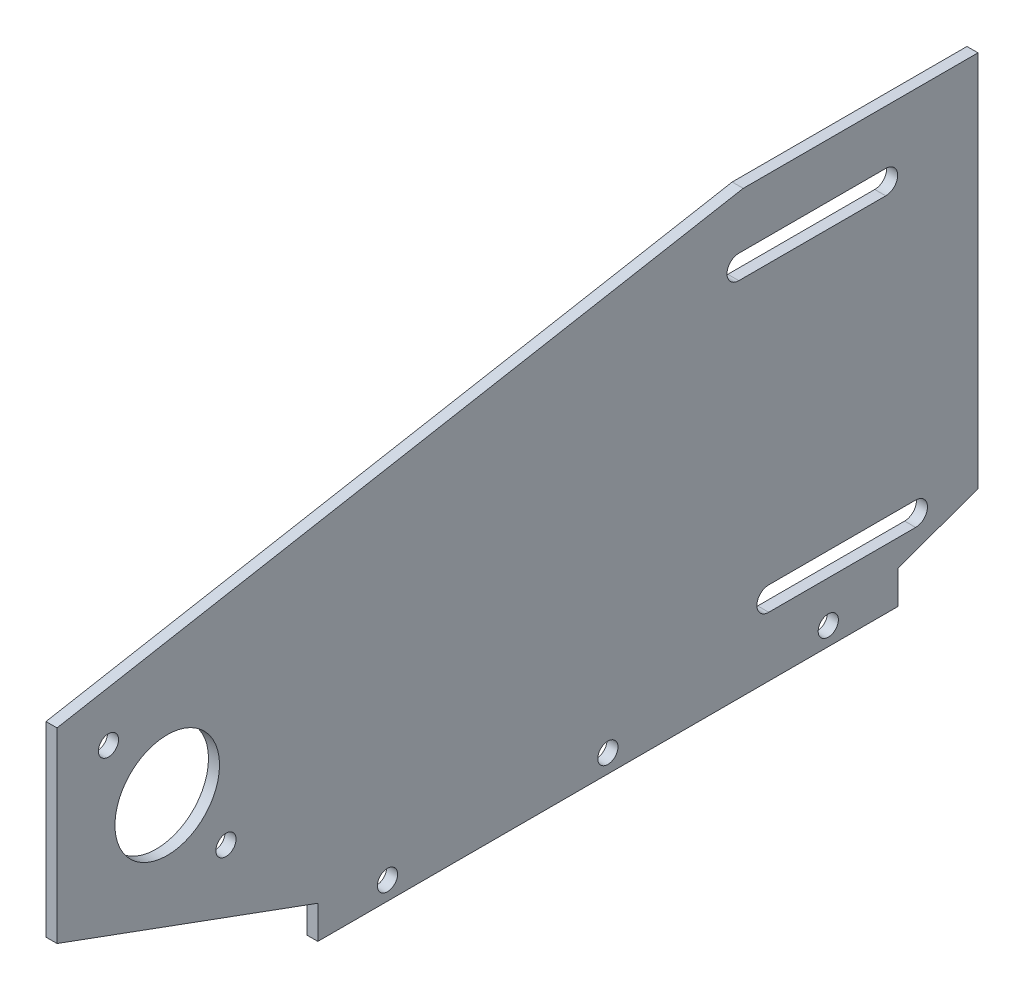
ISO-10303-21;
HEADER;
FILE_DESCRIPTION(('STEP AP214'),'2;1');
FILE_NAME('part.step','',(''),(''),'','','');
FILE_SCHEMA(('AUTOMOTIVE_DESIGN { 1 0 10303 214 1 1 1 1 }'));
ENDSEC;
DATA;
#1=APPLICATION_CONTEXT('core data for automotive mechanical design processes');
#2=APPLICATION_PROTOCOL_DEFINITION('international standard','automotive_design',2000,#1);
#3=PRODUCT_CONTEXT('',#1,'mechanical');
#4=PRODUCT('Part','Part','',(#3));
#5=PRODUCT_RELATED_PRODUCT_CATEGORY('part','',(#4));
#6=PRODUCT_DEFINITION_FORMATION('','',#4);
#7=PRODUCT_DEFINITION_CONTEXT('part definition',#1,'design');
#8=PRODUCT_DEFINITION('design','',#6,#7);
#9=PRODUCT_DEFINITION_SHAPE('','',#8);
#10=(LENGTH_UNIT() NAMED_UNIT(*) SI_UNIT(.MILLI.,.METRE.));
#11=(NAMED_UNIT(*) PLANE_ANGLE_UNIT() SI_UNIT($,.RADIAN.));
#12=(NAMED_UNIT(*) SI_UNIT($,.STERADIAN.) SOLID_ANGLE_UNIT());
#13=UNCERTAINTY_MEASURE_WITH_UNIT(LENGTH_MEASURE(1.E-05),#10,'distance_accuracy_value','');
#14=(GEOMETRIC_REPRESENTATION_CONTEXT(3) GLOBAL_UNCERTAINTY_ASSIGNED_CONTEXT((#13)) GLOBAL_UNIT_ASSIGNED_CONTEXT((#10,
#11,#12)) REPRESENTATION_CONTEXT('',''));
#15=CARTESIAN_POINT('',(0.,0.,0.));
#16=DIRECTION('',(0.,0.,1.));
#17=DIRECTION('',(1.,0.,0.));
#18=AXIS2_PLACEMENT_3D('',#15,#16,#17);
#19=CARTESIAN_POINT('',(3.,0.,0.));
#20=DIRECTION('',(-1.,0.,0.));
#21=DIRECTION('',(0.,0.,1.));
#22=AXIS2_PLACEMENT_3D('',#19,#20,#21);
#23=PLANE('',#22);
#24=CARTESIAN_POINT('',(3.,4.99999999999997,-209.962016184999));
#25=DIRECTION('',(-1.,0.,0.));
#26=DIRECTION('',(0.,0.,1.));
#27=AXIS2_PLACEMENT_3D('',#24,#25,#26);
#28=CIRCLE('',#27,2.75000000000001);
#29=CARTESIAN_POINT('',(3.,4.99999999999997,-207.212016184999));
#30=VERTEX_POINT('',#29);
#31=EDGE_CURVE('E187',#30,#30,#28,.T.);
#32=ORIENTED_EDGE('',*,*,#31,.T.);
#33=EDGE_LOOP('',(#32));
#34=FACE_BOUND('',#33,.T.);
#35=CARTESIAN_POINT('',(3.,4.99999999999997,-149.962016184999));
#36=DIRECTION('',(-1.,0.,0.));
#37=DIRECTION('',(0.,0.,1.));
#38=AXIS2_PLACEMENT_3D('',#35,#36,#37);
#39=CIRCLE('',#38,2.75000000000001);
#40=CARTESIAN_POINT('',(3.,4.99999999999997,-147.212016184999));
#41=VERTEX_POINT('',#40);
#42=EDGE_CURVE('E290',#41,#41,#39,.T.);
#43=ORIENTED_EDGE('',*,*,#42,.T.);
#44=EDGE_LOOP('',(#43));
#45=FACE_BOUND('',#44,.T.);
#46=CARTESIAN_POINT('',(3.,4.99999999999997,-89.9620161849988));
#47=DIRECTION('',(-1.,0.,0.));
#48=DIRECTION('',(0.,0.,1.));
#49=AXIS2_PLACEMENT_3D('',#46,#47,#48);
#50=CIRCLE('',#49,2.75000000000001);
#51=CARTESIAN_POINT('',(3.,4.99999999999997,-87.2120161849988));
#52=VERTEX_POINT('',#51);
#53=EDGE_CURVE('E294',#52,#52,#50,.T.);
#54=ORIENTED_EDGE('',*,*,#53,.T.);
#55=EDGE_LOOP('',(#54));
#56=FACE_BOUND('',#55,.T.);
#57=CARTESIAN_POINT('',(3.,55.,-30.));
#58=DIRECTION('',(1.,0.,0.));
#59=DIRECTION('',(0.,0.,-1.));
#60=AXIS2_PLACEMENT_3D('',#57,#58,#59);
#61=CIRCLE('',#60,14.235);
#62=CARTESIAN_POINT('',(3.,55.,-44.235));
#63=VERTEX_POINT('',#62);
#64=EDGE_CURVE('E210',#63,#63,#61,.T.);
#65=ORIENTED_EDGE('',*,*,#64,.F.);
#66=EDGE_LOOP('',(#65));
#67=FACE_BOUND('',#66,.T.);
#68=DIRECTION('',(0.,0.,-1.));
#69=VECTOR('',#68,1.);
#70=CARTESIAN_POINT('',(3.,98.4784135911546,-185.611446384296));
#71=LINE('',#70,#69);
#72=CARTESIAN_POINT('',(3.,98.4784135911546,-185.611446384296));
#73=VERTEX_POINT('',#72);
#74=CARTESIAN_POINT('',(3.,98.4784135911546,-225.611446384296));
#75=VERTEX_POINT('',#74);
#76=EDGE_CURVE('E766',#73,#75,#71,.T.);
#77=ORIENTED_EDGE('',*,*,#76,.F.);
#78=CARTESIAN_POINT('',(3.,101.708413591155,-185.611446384296));
#79=DIRECTION('',(-1.,0.,0.));
#80=DIRECTION('',(0.,0.,1.));
#81=AXIS2_PLACEMENT_3D('',#78,#79,#80);
#82=CIRCLE('',#81,3.22999999999997);
#83=CARTESIAN_POINT('',(3.,104.938413591155,-185.611446384296));
#84=VERTEX_POINT('',#83);
#85=EDGE_CURVE('E772',#84,#73,#82,.F.);
#86=ORIENTED_EDGE('',*,*,#85,.F.);
#87=DIRECTION('',(0.,0.,1.));
#88=VECTOR('',#87,1.);
#89=CARTESIAN_POINT('',(3.,104.938413591155,-185.611446384296));
#90=LINE('',#89,#88);
#91=CARTESIAN_POINT('',(3.,104.938413591155,-225.611446384296));
#92=VERTEX_POINT('',#91);
#93=EDGE_CURVE('E703',#92,#84,#90,.T.);
#94=ORIENTED_EDGE('',*,*,#93,.F.);
#95=CARTESIAN_POINT('',(3.,101.708413591155,-225.611446384296));
#96=DIRECTION('',(-1.,0.,0.));
#97=DIRECTION('',(0.,0.,1.));
#98=AXIS2_PLACEMENT_3D('',#95,#96,#97);
#99=CIRCLE('',#98,3.22999999999997);
#100=EDGE_CURVE('E762',#75,#92,#99,.F.);
#101=ORIENTED_EDGE('',*,*,#100,.F.);
#102=EDGE_LOOP('',(#77,#86,#94,#101));
#103=FACE_BOUND('',#102,.T.);
#104=DIRECTION('',(0.,0.,1.));
#105=VECTOR('',#104,1.);
#106=CARTESIAN_POINT('',(3.,22.6816943557675,-233.743605698184));
#107=LINE('',#106,#105);
#108=CARTESIAN_POINT('',(3.,22.6816943557675,-233.743605698184));
#109=VERTEX_POINT('',#108);
#110=CARTESIAN_POINT('',(3.,22.6816943557675,-193.743605698184));
#111=VERTEX_POINT('',#110);
#112=EDGE_CURVE('E756',#109,#111,#107,.T.);
#113=ORIENTED_EDGE('',*,*,#112,.F.);
#114=CARTESIAN_POINT('',(3.,19.4566943557675,-233.743605698184));
#115=DIRECTION('',(-1.,0.,0.));
#116=DIRECTION('',(0.,0.,1.));
#117=AXIS2_PLACEMENT_3D('',#114,#115,#116);
#118=CIRCLE('',#117,3.225);
#119=CARTESIAN_POINT('',(3.,16.2316943557675,-233.743605698184));
#120=VERTEX_POINT('',#119);
#121=EDGE_CURVE('E754',#120,#109,#118,.F.);
#122=ORIENTED_EDGE('',*,*,#121,.F.);
#123=DIRECTION('',(0.,0.,-1.));
#124=VECTOR('',#123,1.);
#125=CARTESIAN_POINT('',(3.,16.2316943557675,-233.743605698184));
#126=LINE('',#125,#124);
#127=CARTESIAN_POINT('',(3.,16.2316943557675,-193.743605698184));
#128=VERTEX_POINT('',#127);
#129=EDGE_CURVE('E260',#128,#120,#126,.T.);
#130=ORIENTED_EDGE('',*,*,#129,.F.);
#131=CARTESIAN_POINT('',(3.,19.4566943557675,-193.743605698184));
#132=DIRECTION('',(-1.,0.,0.));
#133=DIRECTION('',(0.,0.,1.));
#134=AXIS2_PLACEMENT_3D('',#131,#132,#133);
#135=CIRCLE('',#134,3.225);
#136=EDGE_CURVE('E761',#111,#128,#135,.F.);
#137=ORIENTED_EDGE('',*,*,#136,.F.);
#138=EDGE_LOOP('',(#113,#122,#130,#137));
#139=FACE_BOUND('',#138,.T.);
#140=CARTESIAN_POINT('',(3.,74.7317953801237,-14.0057431846019));
#141=DIRECTION('',(1.,0.,0.));
#142=DIRECTION('',(0.,0.,-1.));
#143=AXIS2_PLACEMENT_3D('',#140,#141,#142);
#144=CIRCLE('',#143,2.75);
#145=CARTESIAN_POINT('',(3.,74.7317953801237,-16.7557431846019));
#146=VERTEX_POINT('',#145);
#147=EDGE_CURVE('E262',#146,#146,#144,.T.);
#148=ORIENTED_EDGE('',*,*,#147,.F.);
#149=EDGE_LOOP('',(#148));
#150=FACE_BOUND('',#149,.T.);
#151=CARTESIAN_POINT('',(3.,35.2682046198761,-45.9942568153991));
#152=DIRECTION('',(1.,0.,0.));
#153=DIRECTION('',(0.,0.,-1.));
#154=AXIS2_PLACEMENT_3D('',#151,#152,#153);
#155=CIRCLE('',#154,2.75);
#156=CARTESIAN_POINT('',(3.,35.2682046198761,-48.7442568153991));
#157=VERTEX_POINT('',#156);
#158=EDGE_CURVE('E256',#157,#157,#155,.T.);
#159=ORIENTED_EDGE('',*,*,#158,.F.);
#160=EDGE_LOOP('',(#159));
#161=FACE_BOUND('',#160,.T.);
#162=DIRECTION('',(0.,0.178012042619946,-0.984028308882562));
#163=VECTOR('',#162,1.);
#164=CARTESIAN_POINT('',(3.,85.8486317971625,0.));
#165=LINE('',#164,#163);
#166=CARTESIAN_POINT('',(3.,85.8486317971625,0.));
#167=VERTEX_POINT('',#166);
#168=CARTESIAN_POINT('',(3.,119.641480315501,-186.802640374282));
#169=VERTEX_POINT('',#168);
#170=EDGE_CURVE('E175',#167,#169,#165,.T.);
#171=ORIENTED_EDGE('',*,*,#170,.F.);
#172=DIRECTION('',(0.,-1.,0.));
#173=VECTOR('',#172,1.);
#174=CARTESIAN_POINT('',(3.,0.,0.));
#175=LINE('',#174,#173);
#176=CARTESIAN_POINT('',(3.,35.,0.));
#177=VERTEX_POINT('',#176);
#178=EDGE_CURVE('E185',#167,#177,#175,.T.);
#179=ORIENTED_EDGE('',*,*,#178,.T.);
#180=DIRECTION('',(0.,0.343866011956347,0.939018724957728));
#181=VECTOR('',#180,1.);
#182=CARTESIAN_POINT('',(3.,8.99999999999993,-71.000000000001));
#183=LINE('',#182,#181);
#184=CARTESIAN_POINT('',(3.,8.99999999999993,-71.000000000001));
#185=VERTEX_POINT('',#184);
#186=EDGE_CURVE('E245',#185,#177,#183,.T.);
#187=ORIENTED_EDGE('',*,*,#186,.F.);
#188=DIRECTION('',(0.,1.,-1.07938349616336E-13));
#189=VECTOR('',#188,1.);
#190=CARTESIAN_POINT('',(3.,0.,-71.));
#191=LINE('',#190,#189);
#192=CARTESIAN_POINT('',(3.,0.,-71.));
#193=VERTEX_POINT('',#192);
#194=EDGE_CURVE('E240',#193,#185,#191,.T.);
#195=ORIENTED_EDGE('',*,*,#194,.F.);
#196=DIRECTION('',(0.,0.,-1.));
#197=VECTOR('',#196,1.);
#198=CARTESIAN_POINT('',(3.,0.,0.));
#199=LINE('',#198,#197);
#200=CARTESIAN_POINT('',(3.,0.,-228.924032369997));
#201=VERTEX_POINT('',#200);
#202=EDGE_CURVE('E194',#193,#201,#199,.T.);
#203=ORIENTED_EDGE('',*,*,#202,.T.);
#204=DIRECTION('',(0.,-1.,1.07938349616336E-13));
#205=VECTOR('',#204,1.);
#206=CARTESIAN_POINT('',(3.,0.,-228.924032369998));
#207=LINE('',#206,#205);
#208=CARTESIAN_POINT('',(3.,8.99999999999988,-228.924032369999));
#209=VERTEX_POINT('',#208);
#210=EDGE_CURVE('E74',#209,#201,#207,.T.);
#211=ORIENTED_EDGE('',*,*,#210,.F.);
#212=DIRECTION('',(0.,-0.339870380460165,0.940472287994634));
#213=VECTOR('',#212,1.);
#214=CARTESIAN_POINT('',(3.,8.99999999999988,-228.924032369999));
#215=LINE('',#214,#213);
#216=CARTESIAN_POINT('',(3.,16.8759471545119,-250.717958720685));
#217=VERTEX_POINT('',#216);
#218=EDGE_CURVE('E228',#217,#209,#215,.T.);
#219=ORIENTED_EDGE('',*,*,#218,.F.);
#220=DIRECTION('',(0.,-1.,0.));
#221=VECTOR('',#220,1.);
#222=CARTESIAN_POINT('',(3.,16.8759471545119,-250.717958720685));
#223=LINE('',#222,#221);
#224=CARTESIAN_POINT('',(3.,119.641480315501,-250.717958720685));
#225=VERTEX_POINT('',#224);
#226=EDGE_CURVE('E222',#225,#217,#223,.T.);
#227=ORIENTED_EDGE('',*,*,#226,.F.);
#228=DIRECTION('',(0.,0.,-1.));
#229=VECTOR('',#228,1.);
#230=CARTESIAN_POINT('',(3.,119.641480315501,-186.802640374282));
#231=LINE('',#230,#229);
#232=EDGE_CURVE('E178',#169,#225,#231,.T.);
#233=ORIENTED_EDGE('',*,*,#232,.F.);
#234=EDGE_LOOP('',(#171,#179,#187,#195,#203,#211,#219,#227,#233));
#235=FACE_BOUND('',#234,.T.);
#236=ADVANCED_FACE('F52',(#34,#45,#56,#67,#103,#139,#150,#161,#235),#23,.F.);
#237=CARTESIAN_POINT('',(3.,0.,0.));
#238=DIRECTION('',(0.,0.,-1.));
#239=DIRECTION('',(-1.,0.,0.));
#240=AXIS2_PLACEMENT_3D('',#237,#238,#239);
#241=PLANE('',#240);
#242=DIRECTION('',(1.,0.,0.));
#243=VECTOR('',#242,1.);
#244=CARTESIAN_POINT('',(-7.,85.8486317971625,0.));
#245=LINE('',#244,#243);
#246=CARTESIAN_POINT('',(0.,85.8486317971625,0.));
#247=VERTEX_POINT('',#246);
#248=EDGE_CURVE('E169',#247,#167,#245,.T.);
#249=ORIENTED_EDGE('',*,*,#248,.F.);
#250=DIRECTION('',(0.,-1.,0.));
#251=VECTOR('',#250,1.);
#252=CARTESIAN_POINT('',(0.,0.,0.));
#253=LINE('',#252,#251);
#254=CARTESIAN_POINT('',(0.,35.,0.));
#255=VERTEX_POINT('',#254);
#256=EDGE_CURVE('E201',#247,#255,#253,.T.);
#257=ORIENTED_EDGE('',*,*,#256,.T.);
#258=DIRECTION('',(1.,0.,0.));
#259=VECTOR('',#258,1.);
#260=CARTESIAN_POINT('',(0.,35.,0.));
#261=LINE('',#260,#259);
#262=EDGE_CURVE('E188',#255,#177,#261,.T.);
#263=ORIENTED_EDGE('',*,*,#262,.T.);
#264=ORIENTED_EDGE('',*,*,#178,.F.);
#265=EDGE_LOOP('',(#249,#257,#263,#264));
#266=FACE_BOUND('',#265,.T.);
#267=ADVANCED_FACE('F54',(#266),#241,.F.);
#268=CARTESIAN_POINT('',(0.,0.,0.));
#269=DIRECTION('',(-1.,0.,0.));
#270=DIRECTION('',(0.,0.,1.));
#271=AXIS2_PLACEMENT_3D('',#268,#269,#270);
#272=PLANE('',#271);
#273=CARTESIAN_POINT('',(0.,4.99999999999997,-209.962016184999));
#274=DIRECTION('',(-1.,0.,0.));
#275=DIRECTION('',(0.,0.,1.));
#276=AXIS2_PLACEMENT_3D('',#273,#274,#275);
#277=CIRCLE('',#276,2.75000000000001);
#278=CARTESIAN_POINT('',(0.,4.99999999999997,-207.212016184999));
#279=VERTEX_POINT('',#278);
#280=EDGE_CURVE('E285',#279,#279,#277,.T.);
#281=ORIENTED_EDGE('',*,*,#280,.F.);
#282=EDGE_LOOP('',(#281));
#283=FACE_BOUND('',#282,.T.);
#284=CARTESIAN_POINT('',(0.,4.99999999999997,-149.962016184999));
#285=DIRECTION('',(-1.,0.,0.));
#286=DIRECTION('',(0.,0.,1.));
#287=AXIS2_PLACEMENT_3D('',#284,#285,#286);
#288=CIRCLE('',#287,2.75000000000001);
#289=CARTESIAN_POINT('',(0.,4.99999999999997,-147.212016184999));
#290=VERTEX_POINT('',#289);
#291=EDGE_CURVE('E282',#290,#290,#288,.T.);
#292=ORIENTED_EDGE('',*,*,#291,.F.);
#293=EDGE_LOOP('',(#292));
#294=FACE_BOUND('',#293,.T.);
#295=CARTESIAN_POINT('',(0.,4.99999999999997,-89.9620161849988));
#296=DIRECTION('',(-1.,0.,0.));
#297=DIRECTION('',(0.,0.,1.));
#298=AXIS2_PLACEMENT_3D('',#295,#296,#297);
#299=CIRCLE('',#298,2.75000000000001);
#300=CARTESIAN_POINT('',(0.,4.99999999999997,-87.2120161849988));
#301=VERTEX_POINT('',#300);
#302=EDGE_CURVE('E292',#301,#301,#299,.T.);
#303=ORIENTED_EDGE('',*,*,#302,.F.);
#304=EDGE_LOOP('',(#303));
#305=FACE_BOUND('',#304,.T.);
#306=DIRECTION('',(0.,0.,1.));
#307=VECTOR('',#306,1.);
#308=CARTESIAN_POINT('',(0.,119.641480315501,0.));
#309=LINE('',#308,#307);
#310=CARTESIAN_POINT('',(0.,119.641480315501,-250.717958720685));
#311=VERTEX_POINT('',#310);
#312=CARTESIAN_POINT('',(0.,119.641480315501,-186.802640374282));
#313=VERTEX_POINT('',#312);
#314=EDGE_CURVE('E12',#311,#313,#309,.T.);
#315=ORIENTED_EDGE('',*,*,#314,.F.);
#316=DIRECTION('',(0.,1.,0.));
#317=VECTOR('',#316,1.);
#318=CARTESIAN_POINT('',(0.,8.3637132286469E-13,-250.717958720685));
#319=LINE('',#318,#317);
#320=CARTESIAN_POINT('',(0.,16.8759471545119,-250.717958720685));
#321=VERTEX_POINT('',#320);
#322=EDGE_CURVE('E208',#321,#311,#319,.T.);
#323=ORIENTED_EDGE('',*,*,#322,.F.);
#324=DIRECTION('',(0.,0.339870380460165,-0.940472287994635));
#325=VECTOR('',#324,1.);
#326=CARTESIAN_POINT('',(0.,-65.2125811093335,-23.5666962603208));
#327=LINE('',#326,#325);
#328=CARTESIAN_POINT('',(0.,8.99999999999988,-228.924032369999));
#329=VERTEX_POINT('',#328);
#330=EDGE_CURVE('E212',#329,#321,#327,.T.);
#331=ORIENTED_EDGE('',*,*,#330,.F.);
#332=DIRECTION('',(0.,1.,-1.07938349616336E-13));
#333=VECTOR('',#332,1.);
#334=CARTESIAN_POINT('',(0.,-2.47096822415342E-11,-228.924032369998));
#335=LINE('',#334,#333);
#336=CARTESIAN_POINT('',(0.,0.,-228.924032369998));
#337=VERTEX_POINT('',#336);
#338=EDGE_CURVE('E231',#337,#329,#335,.T.);
#339=ORIENTED_EDGE('',*,*,#338,.F.);
#340=DIRECTION('',(0.,0.,-1.));
#341=VECTOR('',#340,1.);
#342=CARTESIAN_POINT('',(0.,0.,0.));
#343=LINE('',#342,#341);
#344=CARTESIAN_POINT('',(0.,0.,-71.));
#345=VERTEX_POINT('',#344);
#346=EDGE_CURVE('E192',#345,#337,#343,.T.);
#347=ORIENTED_EDGE('',*,*,#346,.F.);
#348=DIRECTION('',(0.,1.,-1.07938349616336E-13));
#349=VECTOR('',#348,1.);
#350=CARTESIAN_POINT('',(0.,0.,-71.));
#351=LINE('',#350,#349);
#352=CARTESIAN_POINT('',(0.,8.99999999999993,-71.000000000001));
#353=VERTEX_POINT('',#352);
#354=EDGE_CURVE('E238',#345,#353,#351,.T.);
#355=ORIENTED_EDGE('',*,*,#354,.T.);
#356=DIRECTION('',(0.,0.343866011956347,0.939018724957728));
#357=VECTOR('',#356,1.);
#358=CARTESIAN_POINT('',(0.,8.99999999999993,-71.000000000001));
#359=LINE('',#358,#357);
#360=EDGE_CURVE('E241',#353,#255,#359,.T.);
#361=ORIENTED_EDGE('',*,*,#360,.T.);
#362=ORIENTED_EDGE('',*,*,#256,.F.);
#363=DIRECTION('',(0.,-0.178012042619946,0.984028308882562));
#364=VECTOR('',#363,1.);
#365=CARTESIAN_POINT('',(0.,83.1282356869404,15.0380094764027));
#366=LINE('',#365,#364);
#367=EDGE_CURVE('E63',#313,#247,#366,.T.);
#368=ORIENTED_EDGE('',*,*,#367,.F.);
#369=EDGE_LOOP('',(#315,#323,#331,#339,#347,#355,#361,#362,#368));
#370=FACE_BOUND('',#369,.T.);
#371=CARTESIAN_POINT('',(0.,35.2682046198761,-45.9942568153991));
#372=DIRECTION('',(1.,0.,0.));
#373=DIRECTION('',(0.,0.,-1.));
#374=AXIS2_PLACEMENT_3D('',#371,#372,#373);
#375=CIRCLE('',#374,2.75);
#376=CARTESIAN_POINT('',(0.,35.2682046198761,-48.7442568153991));
#377=VERTEX_POINT('',#376);
#378=EDGE_CURVE('E258',#377,#377,#375,.T.);
#379=ORIENTED_EDGE('',*,*,#378,.T.);
#380=EDGE_LOOP('',(#379));
#381=FACE_BOUND('',#380,.T.);
#382=CARTESIAN_POINT('',(0.,74.7317953801237,-14.0057431846019));
#383=DIRECTION('',(1.,0.,0.));
#384=DIRECTION('',(0.,0.,-1.));
#385=AXIS2_PLACEMENT_3D('',#382,#383,#384);
#386=CIRCLE('',#385,2.75);
#387=CARTESIAN_POINT('',(0.,74.7317953801237,-16.7557431846019));
#388=VERTEX_POINT('',#387);
#389=EDGE_CURVE('E254',#388,#388,#386,.T.);
#390=ORIENTED_EDGE('',*,*,#389,.T.);
#391=EDGE_LOOP('',(#390));
#392=FACE_BOUND('',#391,.T.);
#393=CARTESIAN_POINT('',(0.,19.4566943557675,-233.743605698184));
#394=DIRECTION('',(-1.,0.,0.));
#395=DIRECTION('',(0.,0.,1.));
#396=AXIS2_PLACEMENT_3D('',#393,#394,#395);
#397=CIRCLE('',#396,3.225);
#398=CARTESIAN_POINT('',(0.,22.6816943557675,-233.743605698184));
#399=VERTEX_POINT('',#398);
#400=CARTESIAN_POINT('',(0.,16.2316943557675,-233.743605698184));
#401=VERTEX_POINT('',#400);
#402=EDGE_CURVE('E694',#399,#401,#397,.T.);
#403=ORIENTED_EDGE('',*,*,#402,.F.);
#404=DIRECTION('',(0.,0.,-1.));
#405=VECTOR('',#404,1.);
#406=CARTESIAN_POINT('',(0.,22.6816943557675,-233.743605698184));
#407=LINE('',#406,#405);
#408=CARTESIAN_POINT('',(0.,22.6816943557675,-193.743605698184));
#409=VERTEX_POINT('',#408);
#410=EDGE_CURVE('E739',#409,#399,#407,.T.);
#411=ORIENTED_EDGE('',*,*,#410,.F.);
#412=CARTESIAN_POINT('',(0.,19.4566943557675,-193.743605698184));
#413=DIRECTION('',(-1.,0.,0.));
#414=DIRECTION('',(0.,0.,1.));
#415=AXIS2_PLACEMENT_3D('',#412,#413,#414);
#416=CIRCLE('',#415,3.225);
#417=CARTESIAN_POINT('',(0.,16.2316943557675,-193.743605698184));
#418=VERTEX_POINT('',#417);
#419=EDGE_CURVE('E747',#418,#409,#416,.T.);
#420=ORIENTED_EDGE('',*,*,#419,.F.);
#421=DIRECTION('',(0.,0.,1.));
#422=VECTOR('',#421,1.);
#423=CARTESIAN_POINT('',(0.,16.2316943557675,-233.743605698184));
#424=LINE('',#423,#422);
#425=EDGE_CURVE('E749',#401,#418,#424,.T.);
#426=ORIENTED_EDGE('',*,*,#425,.F.);
#427=EDGE_LOOP('',(#403,#411,#420,#426));
#428=FACE_BOUND('',#427,.T.);
#429=CARTESIAN_POINT('',(0.,101.708413591155,-185.611446384296));
#430=DIRECTION('',(-1.,0.,0.));
#431=DIRECTION('',(0.,0.,1.));
#432=AXIS2_PLACEMENT_3D('',#429,#430,#431);
#433=CIRCLE('',#432,3.22999999999997);
#434=CARTESIAN_POINT('',(0.,98.4784135911546,-185.611446384296));
#435=VERTEX_POINT('',#434);
#436=CARTESIAN_POINT('',(0.,104.938413591155,-185.611446384296));
#437=VERTEX_POINT('',#436);
#438=EDGE_CURVE('E699',#435,#437,#433,.T.);
#439=ORIENTED_EDGE('',*,*,#438,.F.);
#440=DIRECTION('',(0.,0.,1.));
#441=VECTOR('',#440,1.);
#442=CARTESIAN_POINT('',(0.,98.4784135911546,-185.611446384296));
#443=LINE('',#442,#441);
#444=CARTESIAN_POINT('',(0.,98.4784135911546,-225.611446384296));
#445=VERTEX_POINT('',#444);
#446=EDGE_CURVE('E783',#445,#435,#443,.T.);
#447=ORIENTED_EDGE('',*,*,#446,.F.);
#448=CARTESIAN_POINT('',(0.,101.708413591155,-225.611446384296));
#449=DIRECTION('',(-1.,0.,0.));
#450=DIRECTION('',(0.,0.,1.));
#451=AXIS2_PLACEMENT_3D('',#448,#449,#450);
#452=CIRCLE('',#451,3.22999999999997);
#453=CARTESIAN_POINT('',(0.,104.938413591155,-225.611446384296));
#454=VERTEX_POINT('',#453);
#455=EDGE_CURVE('E777',#454,#445,#452,.T.);
#456=ORIENTED_EDGE('',*,*,#455,.F.);
#457=DIRECTION('',(0.,0.,-1.));
#458=VECTOR('',#457,1.);
#459=CARTESIAN_POINT('',(0.,104.938413591155,-185.611446384296));
#460=LINE('',#459,#458);
#461=EDGE_CURVE('E773',#437,#454,#460,.T.);
#462=ORIENTED_EDGE('',*,*,#461,.F.);
#463=EDGE_LOOP('',(#439,#447,#456,#462));
#464=FACE_BOUND('',#463,.T.);
#465=CARTESIAN_POINT('',(0.,55.,-30.));
#466=DIRECTION('',(1.,0.,0.));
#467=DIRECTION('',(0.,0.,-1.));
#468=AXIS2_PLACEMENT_3D('',#465,#466,#467);
#469=CIRCLE('',#468,14.235);
#470=CARTESIAN_POINT('',(0.,55.,-44.235));
#471=VERTEX_POINT('',#470);
#472=EDGE_CURVE('E203',#471,#471,#469,.T.);
#473=ORIENTED_EDGE('',*,*,#472,.T.);
#474=EDGE_LOOP('',(#473));
#475=FACE_BOUND('',#474,.T.);
#476=ADVANCED_FACE('F680',(#283,#294,#305,#370,#381,#392,#428,#464,#475),#272,.T.);
#477=CARTESIAN_POINT('',(3.,0.,0.));
#478=DIRECTION('',(0.,1.,0.));
#479=DIRECTION('',(0.,0.,1.));
#480=AXIS2_PLACEMENT_3D('',#477,#478,#479);
#481=PLANE('',#480);
#482=ORIENTED_EDGE('',*,*,#346,.T.);
#483=DIRECTION('',(1.,0.,0.));
#484=VECTOR('',#483,1.);
#485=CARTESIAN_POINT('',(3.,0.,-228.924032369997));
#486=LINE('',#485,#484);
#487=EDGE_CURVE('E196',#337,#201,#486,.T.);
#488=ORIENTED_EDGE('',*,*,#487,.T.);
#489=ORIENTED_EDGE('',*,*,#202,.F.);
#490=DIRECTION('',(1.,0.,0.));
#491=VECTOR('',#490,1.);
#492=CARTESIAN_POINT('',(0.,0.,-71.));
#493=LINE('',#492,#491);
#494=EDGE_CURVE('E252',#345,#193,#493,.T.);
#495=ORIENTED_EDGE('',*,*,#494,.F.);
#496=EDGE_LOOP('',(#482,#488,#489,#495));
#497=FACE_BOUND('',#496,.T.);
#498=ADVANCED_FACE('F679',(#497),#481,.F.);
#499=CARTESIAN_POINT('',(3.,55.,-30.));
#500=DIRECTION('',(-1.,0.,0.));
#501=DIRECTION('',(0.,0.,1.));
#502=AXIS2_PLACEMENT_3D('',#499,#500,#501);
#503=CYLINDRICAL_SURFACE('',#502,14.235);
#504=ORIENTED_EDGE('',*,*,#64,.T.);
#505=EDGE_LOOP('',(#504));
#506=FACE_BOUND('',#505,.T.);
#507=ORIENTED_EDGE('',*,*,#472,.F.);
#508=EDGE_LOOP('',(#507));
#509=FACE_BOUND('',#508,.T.);
#510=ADVANCED_FACE('F797',(#506,#509),#503,.F.);
#511=CARTESIAN_POINT('',(3.001,101.708413591155,-185.611446384296));
#512=DIRECTION('',(-1.,0.,0.));
#513=DIRECTION('',(0.,0.,1.));
#514=AXIS2_PLACEMENT_3D('',#511,#512,#513);
#515=CYLINDRICAL_SURFACE('',#514,3.22999999999997);
#516=ORIENTED_EDGE('',*,*,#85,.T.);
#517=DIRECTION('',(-1.,0.,0.));
#518=VECTOR('',#517,1.);
#519=CARTESIAN_POINT('',(3.001,98.4784135911546,-185.611446384296));
#520=LINE('',#519,#518);
#521=EDGE_CURVE('E706',#73,#435,#520,.T.);
#522=ORIENTED_EDGE('',*,*,#521,.T.);
#523=ORIENTED_EDGE('',*,*,#438,.T.);
#524=DIRECTION('',(-1.,0.,0.));
#525=VECTOR('',#524,1.);
#526=CARTESIAN_POINT('',(3.001,104.938413591155,-185.611446384296));
#527=LINE('',#526,#525);
#528=EDGE_CURVE('E722',#84,#437,#527,.T.);
#529=ORIENTED_EDGE('',*,*,#528,.F.);
#530=EDGE_LOOP('',(#516,#522,#523,#529));
#531=FACE_BOUND('',#530,.T.);
#532=ADVANCED_FACE('F798',(#531),#515,.F.);
#533=CARTESIAN_POINT('',(3.001,98.4784135911546,-185.611446384296));
#534=DIRECTION('',(0.,-1.,0.));
#535=DIRECTION('',(0.,0.,-1.));
#536=AXIS2_PLACEMENT_3D('',#533,#534,#535);
#537=PLANE('',#536);
#538=ORIENTED_EDGE('',*,*,#76,.T.);
#539=DIRECTION('',(-1.,0.,0.));
#540=VECTOR('',#539,1.);
#541=CARTESIAN_POINT('',(3.001,98.4784135911546,-225.611446384296));
#542=LINE('',#541,#540);
#543=EDGE_CURVE('E719',#75,#445,#542,.T.);
#544=ORIENTED_EDGE('',*,*,#543,.T.);
#545=ORIENTED_EDGE('',*,*,#446,.T.);
#546=ORIENTED_EDGE('',*,*,#521,.F.);
#547=EDGE_LOOP('',(#538,#544,#545,#546));
#548=FACE_BOUND('',#547,.T.);
#549=ADVANCED_FACE('F791',(#548),#537,.F.);
#550=CARTESIAN_POINT('',(3.001,101.708413591155,-225.611446384296));
#551=DIRECTION('',(-1.,0.,0.));
#552=DIRECTION('',(0.,0.,1.));
#553=AXIS2_PLACEMENT_3D('',#550,#551,#552);
#554=CYLINDRICAL_SURFACE('',#553,3.22999999999997);
#555=ORIENTED_EDGE('',*,*,#100,.T.);
#556=DIRECTION('',(-1.,0.,0.));
#557=VECTOR('',#556,1.);
#558=CARTESIAN_POINT('',(3.001,104.938413591155,-225.611446384296));
#559=LINE('',#558,#557);
#560=EDGE_CURVE('E784',#92,#454,#559,.T.);
#561=ORIENTED_EDGE('',*,*,#560,.T.);
#562=ORIENTED_EDGE('',*,*,#455,.T.);
#563=ORIENTED_EDGE('',*,*,#543,.F.);
#564=EDGE_LOOP('',(#555,#561,#562,#563));
#565=FACE_BOUND('',#564,.T.);
#566=ADVANCED_FACE('F788',(#565),#554,.F.);
#567=CARTESIAN_POINT('',(3.001,104.938413591155,-185.611446384296));
#568=DIRECTION('',(0.,1.,0.));
#569=DIRECTION('',(0.,0.,1.));
#570=AXIS2_PLACEMENT_3D('',#567,#568,#569);
#571=PLANE('',#570);
#572=ORIENTED_EDGE('',*,*,#93,.T.);
#573=ORIENTED_EDGE('',*,*,#528,.T.);
#574=ORIENTED_EDGE('',*,*,#461,.T.);
#575=ORIENTED_EDGE('',*,*,#560,.F.);
#576=EDGE_LOOP('',(#572,#573,#574,#575));
#577=FACE_BOUND('',#576,.T.);
#578=ADVANCED_FACE('F786',(#577),#571,.F.);
#579=CARTESIAN_POINT('',(3.001,19.4566943557675,-233.743605698184));
#580=DIRECTION('',(-1.,0.,0.));
#581=DIRECTION('',(0.,0.,1.));
#582=AXIS2_PLACEMENT_3D('',#579,#580,#581);
#583=CYLINDRICAL_SURFACE('',#582,3.225);
#584=ORIENTED_EDGE('',*,*,#121,.T.);
#585=DIRECTION('',(-1.,0.,0.));
#586=VECTOR('',#585,1.);
#587=CARTESIAN_POINT('',(3.001,22.6816943557675,-233.743605698184));
#588=LINE('',#587,#586);
#589=EDGE_CURVE('E731',#109,#399,#588,.T.);
#590=ORIENTED_EDGE('',*,*,#589,.T.);
#591=ORIENTED_EDGE('',*,*,#402,.T.);
#592=DIRECTION('',(-1.,0.,0.));
#593=VECTOR('',#592,1.);
#594=CARTESIAN_POINT('',(3.001,16.2316943557675,-233.743605698184));
#595=LINE('',#594,#593);
#596=EDGE_CURVE('E738',#120,#401,#595,.T.);
#597=ORIENTED_EDGE('',*,*,#596,.F.);
#598=EDGE_LOOP('',(#584,#590,#591,#597));
#599=FACE_BOUND('',#598,.T.);
#600=ADVANCED_FACE('F860',(#599),#583,.F.);
#601=CARTESIAN_POINT('',(3.001,22.6816943557675,-233.743605698184));
#602=DIRECTION('',(0.,1.,0.));
#603=DIRECTION('',(0.,0.,1.));
#604=AXIS2_PLACEMENT_3D('',#601,#602,#603);
#605=PLANE('',#604);
#606=ORIENTED_EDGE('',*,*,#112,.T.);
#607=DIRECTION('',(-1.,0.,0.));
#608=VECTOR('',#607,1.);
#609=CARTESIAN_POINT('',(3.001,22.6816943557675,-193.743605698184));
#610=LINE('',#609,#608);
#611=EDGE_CURVE('E745',#111,#409,#610,.T.);
#612=ORIENTED_EDGE('',*,*,#611,.T.);
#613=ORIENTED_EDGE('',*,*,#410,.T.);
#614=ORIENTED_EDGE('',*,*,#589,.F.);
#615=EDGE_LOOP('',(#606,#612,#613,#614));
#616=FACE_BOUND('',#615,.T.);
#617=ADVANCED_FACE('F858',(#616),#605,.F.);
#618=CARTESIAN_POINT('',(3.001,19.4566943557675,-193.743605698184));
#619=DIRECTION('',(-1.,0.,0.));
#620=DIRECTION('',(0.,0.,1.));
#621=AXIS2_PLACEMENT_3D('',#618,#619,#620);
#622=CYLINDRICAL_SURFACE('',#621,3.225);
#623=ORIENTED_EDGE('',*,*,#136,.T.);
#624=DIRECTION('',(-1.,0.,0.));
#625=VECTOR('',#624,1.);
#626=CARTESIAN_POINT('',(3.001,16.2316943557675,-193.743605698184));
#627=LINE('',#626,#625);
#628=EDGE_CURVE('E737',#128,#418,#627,.T.);
#629=ORIENTED_EDGE('',*,*,#628,.T.);
#630=ORIENTED_EDGE('',*,*,#419,.T.);
#631=ORIENTED_EDGE('',*,*,#611,.F.);
#632=EDGE_LOOP('',(#623,#629,#630,#631));
#633=FACE_BOUND('',#632,.T.);
#634=ADVANCED_FACE('F865',(#633),#622,.F.);
#635=CARTESIAN_POINT('',(3.001,16.2316943557675,-233.743605698184));
#636=DIRECTION('',(0.,-1.,0.));
#637=DIRECTION('',(0.,0.,-1.));
#638=AXIS2_PLACEMENT_3D('',#635,#636,#637);
#639=PLANE('',#638);
#640=ORIENTED_EDGE('',*,*,#129,.T.);
#641=ORIENTED_EDGE('',*,*,#596,.T.);
#642=ORIENTED_EDGE('',*,*,#425,.T.);
#643=ORIENTED_EDGE('',*,*,#628,.F.);
#644=EDGE_LOOP('',(#640,#641,#642,#643));
#645=FACE_BOUND('',#644,.T.);
#646=ADVANCED_FACE('F854',(#645),#639,.F.);
#647=CARTESIAN_POINT('',(0.,74.7317953801237,-14.0057431846019));
#648=DIRECTION('',(1.,0.,0.));
#649=DIRECTION('',(0.,0.,-1.));
#650=AXIS2_PLACEMENT_3D('',#647,#648,#649);
#651=CYLINDRICAL_SURFACE('',#650,2.75);
#652=ORIENTED_EDGE('',*,*,#389,.F.);
#653=EDGE_LOOP('',(#652));
#654=FACE_BOUND('',#653,.T.);
#655=ORIENTED_EDGE('',*,*,#147,.T.);
#656=EDGE_LOOP('',(#655));
#657=FACE_BOUND('',#656,.T.);
#658=ADVANCED_FACE('F851',(#654,#657),#651,.F.);
#659=CARTESIAN_POINT('',(0.,35.2682046198761,-45.9942568153991));
#660=DIRECTION('',(1.,0.,0.));
#661=DIRECTION('',(0.,0.,-1.));
#662=AXIS2_PLACEMENT_3D('',#659,#660,#661);
#663=CYLINDRICAL_SURFACE('',#662,2.75);
#664=ORIENTED_EDGE('',*,*,#378,.F.);
#665=EDGE_LOOP('',(#664));
#666=FACE_BOUND('',#665,.T.);
#667=ORIENTED_EDGE('',*,*,#158,.T.);
#668=EDGE_LOOP('',(#667));
#669=FACE_BOUND('',#668,.T.);
#670=ADVANCED_FACE('F841',(#666,#669),#663,.F.);
#671=CARTESIAN_POINT('',(0.,0.,-71.));
#672=DIRECTION('',(0.,-1.07938349616336E-13,-1.));
#673=DIRECTION('',(0.,1.,-1.07938349616336E-13));
#674=AXIS2_PLACEMENT_3D('',#671,#672,#673);
#675=PLANE('',#674);
#676=ORIENTED_EDGE('',*,*,#194,.T.);
#677=DIRECTION('',(1.,0.,0.));
#678=VECTOR('',#677,1.);
#679=CARTESIAN_POINT('',(0.,8.99999999999993,-71.000000000001));
#680=LINE('',#679,#678);
#681=EDGE_CURVE('E246',#353,#185,#680,.T.);
#682=ORIENTED_EDGE('',*,*,#681,.F.);
#683=ORIENTED_EDGE('',*,*,#354,.F.);
#684=ORIENTED_EDGE('',*,*,#494,.T.);
#685=EDGE_LOOP('',(#676,#682,#683,#684));
#686=FACE_BOUND('',#685,.T.);
#687=ADVANCED_FACE('F834',(#686),#675,.F.);
#688=CARTESIAN_POINT('',(0.,8.99999999999993,-71.000000000001));
#689=DIRECTION('',(0.,0.939018724957728,-0.343866011956347));
#690=DIRECTION('',(0.,0.343866011956347,0.939018724957728));
#691=AXIS2_PLACEMENT_3D('',#688,#689,#690);
#692=PLANE('',#691);
#693=ORIENTED_EDGE('',*,*,#186,.T.);
#694=ORIENTED_EDGE('',*,*,#262,.F.);
#695=ORIENTED_EDGE('',*,*,#360,.F.);
#696=ORIENTED_EDGE('',*,*,#681,.T.);
#697=EDGE_LOOP('',(#693,#694,#695,#696));
#698=FACE_BOUND('',#697,.T.);
#699=ADVANCED_FACE('F839',(#698),#692,.F.);
#700=CARTESIAN_POINT('',(-7.,0.,-228.924032369998));
#701=DIRECTION('',(0.,1.07938349616336E-13,1.));
#702=DIRECTION('',(0.,-1.,1.07938349616336E-13));
#703=AXIS2_PLACEMENT_3D('',#700,#701,#702);
#704=PLANE('',#703);
#705=ORIENTED_EDGE('',*,*,#338,.T.);
#706=DIRECTION('',(1.,0.,0.));
#707=VECTOR('',#706,1.);
#708=CARTESIAN_POINT('',(-7.,8.99999999999988,-228.924032369999));
#709=LINE('',#708,#707);
#710=EDGE_CURVE('E233',#329,#209,#709,.T.);
#711=ORIENTED_EDGE('',*,*,#710,.T.);
#712=ORIENTED_EDGE('',*,*,#210,.T.);
#713=ORIENTED_EDGE('',*,*,#487,.F.);
#714=EDGE_LOOP('',(#705,#711,#712,#713));
#715=FACE_BOUND('',#714,.T.);
#716=ADVANCED_FACE('F828',(#715),#704,.F.);
#717=CARTESIAN_POINT('',(-7.,8.99999999999988,-228.924032369999));
#718=DIRECTION('',(0.,0.940472287994635,0.339870380460165));
#719=DIRECTION('',(0.,-0.339870380460165,0.940472287994635));
#720=AXIS2_PLACEMENT_3D('',#717,#718,#719);
#721=PLANE('',#720);
#722=ORIENTED_EDGE('',*,*,#330,.T.);
#723=DIRECTION('',(1.,0.,0.));
#724=VECTOR('',#723,1.);
#725=CARTESIAN_POINT('',(-7.,16.8759471545119,-250.717958720685));
#726=LINE('',#725,#724);
#727=EDGE_CURVE('E229',#321,#217,#726,.T.);
#728=ORIENTED_EDGE('',*,*,#727,.T.);
#729=ORIENTED_EDGE('',*,*,#218,.T.);
#730=ORIENTED_EDGE('',*,*,#710,.F.);
#731=EDGE_LOOP('',(#722,#728,#729,#730));
#732=FACE_BOUND('',#731,.T.);
#733=ADVANCED_FACE('F829',(#732),#721,.F.);
#734=CARTESIAN_POINT('',(-7.,16.8759471545119,-250.717958720685));
#735=DIRECTION('',(0.,0.,1.));
#736=DIRECTION('',(0.,-1.,0.));
#737=AXIS2_PLACEMENT_3D('',#734,#735,#736);
#738=PLANE('',#737);
#739=ORIENTED_EDGE('',*,*,#322,.T.);
#740=DIRECTION('',(1.,0.,0.));
#741=VECTOR('',#740,1.);
#742=CARTESIAN_POINT('',(-7.,119.641480315501,-250.717958720685));
#743=LINE('',#742,#741);
#744=EDGE_CURVE('E215',#311,#225,#743,.T.);
#745=ORIENTED_EDGE('',*,*,#744,.T.);
#746=ORIENTED_EDGE('',*,*,#226,.T.);
#747=ORIENTED_EDGE('',*,*,#727,.F.);
#748=EDGE_LOOP('',(#739,#745,#746,#747));
#749=FACE_BOUND('',#748,.T.);
#750=ADVANCED_FACE('F910',(#749),#738,.F.);
#751=CARTESIAN_POINT('',(-7.,119.641480315501,-186.802640374282));
#752=DIRECTION('',(0.,-1.,0.));
#753=DIRECTION('',(0.,0.,-1.));
#754=AXIS2_PLACEMENT_3D('',#751,#752,#753);
#755=PLANE('',#754);
#756=ORIENTED_EDGE('',*,*,#314,.T.);
#757=DIRECTION('',(1.,0.,0.));
#758=VECTOR('',#757,1.);
#759=CARTESIAN_POINT('',(-7.,119.641480315501,-186.802640374282));
#760=LINE('',#759,#758);
#761=EDGE_CURVE('E66',#313,#169,#760,.T.);
#762=ORIENTED_EDGE('',*,*,#761,.T.);
#763=ORIENTED_EDGE('',*,*,#232,.T.);
#764=ORIENTED_EDGE('',*,*,#744,.F.);
#765=EDGE_LOOP('',(#756,#762,#763,#764));
#766=FACE_BOUND('',#765,.T.);
#767=ADVANCED_FACE('F916',(#766),#755,.F.);
#768=CARTESIAN_POINT('',(-7.,85.8486317971625,0.));
#769=DIRECTION('',(0.,-0.984028308882562,-0.178012042619946));
#770=DIRECTION('',(0.,0.178012042619946,-0.984028308882562));
#771=AXIS2_PLACEMENT_3D('',#768,#769,#770);
#772=PLANE('',#771);
#773=ORIENTED_EDGE('',*,*,#367,.T.);
#774=ORIENTED_EDGE('',*,*,#248,.T.);
#775=ORIENTED_EDGE('',*,*,#170,.T.);
#776=ORIENTED_EDGE('',*,*,#761,.F.);
#777=EDGE_LOOP('',(#773,#774,#775,#776));
#778=FACE_BOUND('',#777,.T.);
#779=ADVANCED_FACE('F171',(#778),#772,.F.);
#780=CARTESIAN_POINT('',(3.,4.99999999999997,-89.9620161849988));
#781=DIRECTION('',(-1.,0.,0.));
#782=DIRECTION('',(0.,0.,1.));
#783=AXIS2_PLACEMENT_3D('',#780,#781,#782);
#784=CYLINDRICAL_SURFACE('',#783,2.75000000000001);
#785=ORIENTED_EDGE('',*,*,#53,.F.);
#786=EDGE_LOOP('',(#785));
#787=FACE_BOUND('',#786,.T.);
#788=ORIENTED_EDGE('',*,*,#302,.T.);
#789=EDGE_LOOP('',(#788));
#790=FACE_BOUND('',#789,.T.);
#791=ADVANCED_FACE('F666',(#787,#790),#784,.F.);
#792=CARTESIAN_POINT('',(3.,4.99999999999997,-149.962016184999));
#793=DIRECTION('',(-1.,0.,0.));
#794=DIRECTION('',(0.,0.,1.));
#795=AXIS2_PLACEMENT_3D('',#792,#793,#794);
#796=CYLINDRICAL_SURFACE('',#795,2.75000000000001);
#797=ORIENTED_EDGE('',*,*,#42,.F.);
#798=EDGE_LOOP('',(#797));
#799=FACE_BOUND('',#798,.T.);
#800=ORIENTED_EDGE('',*,*,#291,.T.);
#801=EDGE_LOOP('',(#800));
#802=FACE_BOUND('',#801,.T.);
#803=ADVANCED_FACE('F671',(#799,#802),#796,.F.);
#804=CARTESIAN_POINT('',(3.,4.99999999999997,-209.962016184999));
#805=DIRECTION('',(-1.,0.,0.));
#806=DIRECTION('',(0.,0.,1.));
#807=AXIS2_PLACEMENT_3D('',#804,#805,#806);
#808=CYLINDRICAL_SURFACE('',#807,2.75000000000001);
#809=ORIENTED_EDGE('',*,*,#31,.F.);
#810=EDGE_LOOP('',(#809));
#811=FACE_BOUND('',#810,.T.);
#812=ORIENTED_EDGE('',*,*,#280,.T.);
#813=EDGE_LOOP('',(#812));
#814=FACE_BOUND('',#813,.T.);
#815=ADVANCED_FACE('F940',(#811,#814),#808,.F.);
#816=CLOSED_SHELL('',(#236,#267,#476,#498,#510,#532,#549,#566,#578,#600,#617,#634,#646,#658,
#670,#687,#699,#716,#733,#750,#767,#779,#791,#803,#815));
#817=MANIFOLD_SOLID_BREP('B2',#816);
#818=ADVANCED_BREP_SHAPE_REPRESENTATION('',(#18,#817),#14);
#819=SHAPE_DEFINITION_REPRESENTATION(#9,#818);
ENDSEC;
END-ISO-10303-21;
